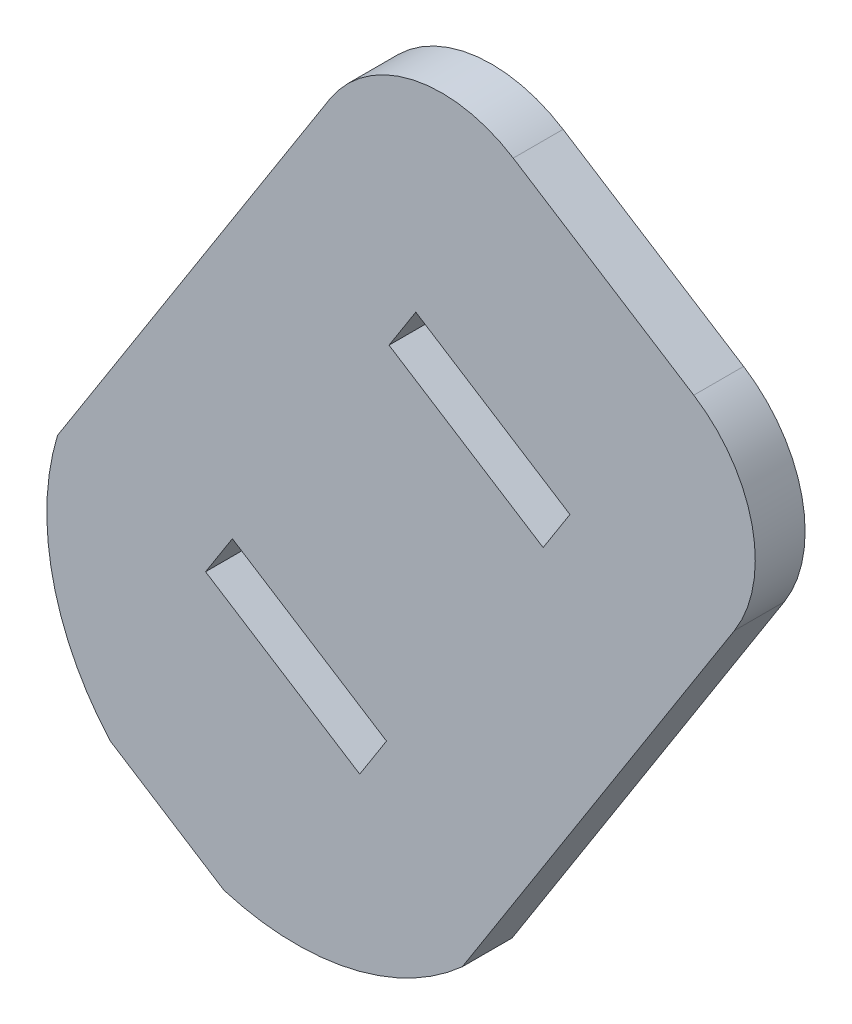
ISO-10303-21;
HEADER;
FILE_DESCRIPTION(('STEP AP214'),'2;1');
FILE_NAME('part.step','',(''),(''),'','','');
FILE_SCHEMA(('AUTOMOTIVE_DESIGN { 1 0 10303 214 1 1 1 1 }'));
ENDSEC;
DATA;
#1=APPLICATION_CONTEXT('core data for automotive mechanical design processes');
#2=APPLICATION_PROTOCOL_DEFINITION('international standard','automotive_design',2000,#1);
#3=PRODUCT_CONTEXT('',#1,'mechanical');
#4=PRODUCT('Part','Part','',(#3));
#5=PRODUCT_RELATED_PRODUCT_CATEGORY('part','',(#4));
#6=PRODUCT_DEFINITION_FORMATION('','',#4);
#7=PRODUCT_DEFINITION_CONTEXT('part definition',#1,'design');
#8=PRODUCT_DEFINITION('design','',#6,#7);
#9=PRODUCT_DEFINITION_SHAPE('','',#8);
#10=(LENGTH_UNIT() NAMED_UNIT(*) SI_UNIT(.MILLI.,.METRE.));
#11=(NAMED_UNIT(*) PLANE_ANGLE_UNIT() SI_UNIT($,.RADIAN.));
#12=(NAMED_UNIT(*) SI_UNIT($,.STERADIAN.) SOLID_ANGLE_UNIT());
#13=UNCERTAINTY_MEASURE_WITH_UNIT(LENGTH_MEASURE(1.E-05),#10,'distance_accuracy_value','');
#14=(GEOMETRIC_REPRESENTATION_CONTEXT(3) GLOBAL_UNCERTAINTY_ASSIGNED_CONTEXT((#13)) GLOBAL_UNIT_ASSIGNED_CONTEXT((#10,
#11,#12)) REPRESENTATION_CONTEXT('',''));
#15=CARTESIAN_POINT('',(0.,0.,0.));
#16=DIRECTION('',(0.,0.,1.));
#17=DIRECTION('',(1.,0.,0.));
#18=AXIS2_PLACEMENT_3D('',#15,#16,#17);
#19=CARTESIAN_POINT('',(20.1241157801377,21.2297377830745,-7.99999999999974));
#20=DIRECTION('',(0.,0.,-1.));
#21=DIRECTION('',(-1.,0.,0.));
#22=AXIS2_PLACEMENT_3D('',#19,#20,#21);
#23=PLANE('',#22);
#24=CARTESIAN_POINT('',(-35.8758842198621,30.3873470763571,-8.00000000000022));
#25=DIRECTION('',(0.,0.,-1.));
#26=DIRECTION('',(-1.,0.,0.));
#27=AXIS2_PLACEMENT_3D('',#24,#25,#26);
#28=CIRCLE('',#27,8.00000000000001);
#29=CARTESIAN_POINT('',(-43.8758842198621,30.3873470763571,-8.00000000000029));
#30=VERTEX_POINT('',#29);
#31=EDGE_CURVE('E164',#30,#30,#28,.F.);
#32=ORIENTED_EDGE('',*,*,#31,.F.);
#33=EDGE_LOOP('',(#32));
#34=FACE_BOUND('',#33,.T.);
#35=DIRECTION('',(0.537299608354291,0.843391445808129,0.));
#36=VECTOR('',#35,1.);
#37=CARTESIAN_POINT('',(-19.2203489028126,46.2949261604625,-8.00000000000013));
#38=LINE('',#37,#36);
#39=CARTESIAN_POINT('',(-32.0431806804489,26.1671120616963,-8.00000000000018));
#40=VERTEX_POINT('',#39);
#41=CARTESIAN_POINT('',(-30.431281855386,28.6972863991207,-8.00000000000018));
#42=VERTEX_POINT('',#41);
#43=EDGE_CURVE('E225',#40,#42,#38,.T.);
#44=ORIENTED_EDGE('',*,*,#43,.T.);
#45=DIRECTION('',(-0.84339144580813,0.53729960835429,0.));
#46=VECTOR('',#45,1.);
#47=CARTESIAN_POINT('',(8.91318282756435,3.63209802173272,-7.99999999999979));
#48=LINE('',#47,#46);
#49=CARTESIAN_POINT('',(-39.7085877592754,34.6075820910179,-8.00000000000027));
#50=VERTEX_POINT('',#49);
#51=EDGE_CURVE('E231',#42,#50,#48,.T.);
#52=ORIENTED_EDGE('',*,*,#51,.T.);
#53=DIRECTION('',(-0.53729960835429,-0.843391445808129,0.));
#54=VECTOR('',#53,1.);
#55=CARTESIAN_POINT('',(-28.4976548067021,52.2052218523597,-8.00000000000022));
#56=LINE('',#55,#54);
#57=CARTESIAN_POINT('',(-41.3204865843383,32.0774077535935,-8.00000000000023));
#58=VERTEX_POINT('',#57);
#59=EDGE_CURVE('E229',#50,#58,#56,.T.);
#60=ORIENTED_EDGE('',*,*,#59,.T.);
#61=DIRECTION('',(0.843391445808129,-0.53729960835429,0.));
#62=VECTOR('',#61,1.);
#63=CARTESIAN_POINT('',(7.30128400250146,1.10192368430831,-7.99999999999979));
#64=LINE('',#63,#62);
#65=EDGE_CURVE('E207',#58,#40,#64,.T.);
#66=ORIENTED_EDGE('',*,*,#65,.T.);
#67=EDGE_LOOP('',(#44,#52,#60,#66));
#68=FACE_BOUND('',#67,.T.);
#69=ADVANCED_FACE('F45',(#34,#68),#23,.T.);
#70=CARTESIAN_POINT('',(0.,0.,3.));
#71=DIRECTION('',(0.,0.,1.));
#72=DIRECTION('',(1.,0.,0.));
#73=AXIS2_PLACEMENT_3D('',#70,#71,#72);
#74=PLANE('',#73);
#75=CARTESIAN_POINT('',(-16.2349408365906,49.2271392015348,3.));
#76=DIRECTION('',(0.,0.,1.));
#77=DIRECTION('',(1.,0.,0.));
#78=AXIS2_PLACEMENT_3D('',#75,#76,#77);
#79=CIRCLE('',#78,8.);
#80=CARTESIAN_POINT('',(-11.9365439697563,55.9742707679999,3.));
#81=VERTEX_POINT('',#80);
#82=CARTESIAN_POINT('',(-9.48780927012557,44.9287423347004,3.));
#83=VERTEX_POINT('',#82);
#84=EDGE_CURVE('E235',#81,#83,#79,.F.);
#85=ORIENTED_EDGE('',*,*,#84,.F.);
#86=DIRECTION('',(-0.843391445808129,0.53729960835429,0.));
#87=VECTOR('',#86,1.);
#88=CARTESIAN_POINT('',(21.9189874824485,34.4059185155461,3.));
#89=LINE('',#88,#87);
#90=CARTESIAN_POINT('',(-22.8034583949571,62.8972587751705,3.));
#91=VERTEX_POINT('',#90);
#92=EDGE_CURVE('E238',#81,#91,#89,.T.);
#93=ORIENTED_EDGE('',*,*,#92,.T.);
#94=CARTESIAN_POINT('',(-27.1018552617915,56.1501272087055,3.));
#95=DIRECTION('',(0.,0.,1.));
#96=DIRECTION('',(1.,0.,0.));
#97=AXIS2_PLACEMENT_3D('',#94,#95,#96);
#98=CIRCLE('',#97,8.);
#99=CARTESIAN_POINT('',(-33.8489868282565,60.4485240755397,3.));
#100=VERTEX_POINT('',#99);
#101=EDGE_CURVE('E241',#91,#100,#98,.T.);
#102=ORIENTED_EDGE('',*,*,#101,.T.);
#103=DIRECTION('',(0.53729960835429,0.843391445808129,0.));
#104=VECTOR('',#103,1.);
#105=CARTESIAN_POINT('',(-51.4695774438707,32.7897371264587,3.));
#106=LINE('',#105,#104);
#107=CARTESIAN_POINT('',(-50.2335212839121,34.729956653215,3.));
#108=VERTEX_POINT('',#107);
#109=EDGE_CURVE('E243',#108,#100,#106,.T.);
#110=ORIENTED_EDGE('',*,*,#109,.F.);
#111=CARTESIAN_POINT('',(-35.8758842198621,30.3873470763571,3.));
#112=DIRECTION('',(0.,0.,1.));
#113=DIRECTION('',(1.,0.,0.));
#114=AXIS2_PLACEMENT_3D('',#111,#112,#113);
#115=CIRCLE('',#114,15.);
#116=CARTESIAN_POINT('',(-47.0530563838433,20.3838065822758,3.));
#117=VERTEX_POINT('',#116);
#118=EDGE_CURVE('E246',#108,#117,#115,.T.);
#119=ORIENTED_EDGE('',*,*,#118,.T.);
#120=DIRECTION('',(0.84339144580813,-0.53729960835429,0.));
#121=VECTOR('',#120,1.);
#122=CARTESIAN_POINT('',(-4.34678642547666,-6.82308795874752,3.));
#123=LINE('',#122,#121);
#124=CARTESIAN_POINT('',(-40.2184937967205,16.0297100123073,3.));
#125=VERTEX_POINT('',#124);
#126=EDGE_CURVE('E248',#117,#125,#123,.T.);
#127=ORIENTED_EDGE('',*,*,#126,.T.);
#128=CARTESIAN_POINT('',(-35.8758842198621,30.3873470763571,3.));
#129=DIRECTION('',(0.,0.,1.));
#130=DIRECTION('',(1.,0.,0.));
#131=AXIS2_PLACEMENT_3D('',#128,#129,#130);
#132=CIRCLE('',#131,15.);
#133=CARTESIAN_POINT('',(-25.8723437257803,19.2101749123764,3.));
#134=VERTEX_POINT('',#133);
#135=EDGE_CURVE('E250',#125,#134,#132,.T.);
#136=ORIENTED_EDGE('',*,*,#135,.T.);
#137=DIRECTION('',(0.537299608354281,0.843391445808135,0.));
#138=VECTOR('',#137,1.);
#139=CARTESIAN_POINT('',(-27.1083998857396,17.2699553856189,3.));
#140=LINE('',#139,#138);
#141=EDGE_CURVE('E252',#134,#83,#140,.T.);
#142=ORIENTED_EDGE('',*,*,#141,.T.);
#143=EDGE_LOOP('',(#85,#93,#102,#110,#119,#127,#136,#142));
#144=FACE_BOUND('',#143,.T.);
#145=DIRECTION('',(0.53729960835429,0.843391445808129,0.));
#146=VECTOR('',#145,1.);
#147=CARTESIAN_POINT('',(-43.9276416167499,27.9849941019876,3.));
#148=LINE('',#147,#146);
#149=CARTESIAN_POINT('',(-41.3204865843383,32.0774077535935,3.));
#150=VERTEX_POINT('',#149);
#151=CARTESIAN_POINT('',(-39.7085877592754,34.6075820910179,3.));
#152=VERTEX_POINT('',#151);
#153=EDGE_CURVE('E52',#150,#152,#148,.T.);
#154=ORIENTED_EDGE('',*,*,#153,.T.);
#155=DIRECTION('',(0.84339144580813,-0.53729960835429,0.));
#156=VECTOR('',#155,1.);
#157=CARTESIAN_POINT('',(4.21905385747451,6.62258798903028,3.));
#158=LINE('',#157,#156);
#159=CARTESIAN_POINT('',(-30.431281855386,28.6972863991207,3.));
#160=VERTEX_POINT('',#159);
#161=EDGE_CURVE('E11',#152,#160,#158,.T.);
#162=ORIENTED_EDGE('',*,*,#161,.T.);
#163=DIRECTION('',(-0.537299608354291,-0.843391445808129,0.));
#164=VECTOR('',#163,1.);
#165=CARTESIAN_POINT('',(-34.6503357128605,22.0746984100905,3.));
#166=LINE('',#165,#164);
#167=CARTESIAN_POINT('',(-32.0431806804489,26.1671120616963,3.));
#168=VERTEX_POINT('',#167);
#169=EDGE_CURVE('E184',#160,#168,#166,.T.);
#170=ORIENTED_EDGE('',*,*,#169,.T.);
#171=DIRECTION('',(-0.843391445808129,0.53729960835429,0.));
#172=VECTOR('',#171,1.);
#173=CARTESIAN_POINT('',(2.60715503241163,4.09241365160587,3.));
#174=LINE('',#173,#172);
#175=EDGE_CURVE('E187',#168,#150,#174,.T.);
#176=ORIENTED_EDGE('',*,*,#175,.T.);
#177=EDGE_LOOP('',(#154,#162,#170,#176));
#178=FACE_BOUND('',#177,.T.);
#179=DIRECTION('',(0.53729960835429,0.843391445808129,0.));
#180=VECTOR('',#179,1.);
#181=CARTESIAN_POINT('',(-43.9276416167499,27.9849941019876,3.));
#182=LINE('',#181,#180);
#183=CARTESIAN_POINT('',(-30.2797304328479,49.4079234447207,3.));
#184=VERTEX_POINT('',#183);
#185=CARTESIAN_POINT('',(-28.667831607785,51.9380977821451,3.));
#186=VERTEX_POINT('',#185);
#187=EDGE_CURVE('E219',#184,#186,#182,.T.);
#188=ORIENTED_EDGE('',*,*,#187,.T.);
#189=DIRECTION('',(0.84339144580813,-0.53729960835429,0.));
#190=VECTOR('',#189,1.);
#191=CARTESIAN_POINT('',(15.2598100089649,23.9531036801574,3.));
#192=LINE('',#191,#190);
#193=CARTESIAN_POINT('',(-19.3905257038956,46.0278020902479,3.));
#194=VERTEX_POINT('',#193);
#195=EDGE_CURVE('E222',#186,#194,#192,.T.);
#196=ORIENTED_EDGE('',*,*,#195,.T.);
#197=DIRECTION('',(-0.53729960835429,-0.843391445808129,0.));
#198=VECTOR('',#197,1.);
#199=CARTESIAN_POINT('',(-34.6503357128605,22.0746984100904,3.));
#200=LINE('',#199,#198);
#201=CARTESIAN_POINT('',(-21.0024245289584,43.4976277528235,3.));
#202=VERTEX_POINT('',#201);
#203=EDGE_CURVE('E215',#194,#202,#200,.T.);
#204=ORIENTED_EDGE('',*,*,#203,.T.);
#205=DIRECTION('',(-0.84339144580813,0.53729960835429,0.));
#206=VECTOR('',#205,1.);
#207=CARTESIAN_POINT('',(13.647911183902,21.422929342733,3.));
#208=LINE('',#207,#206);
#209=EDGE_CURVE('E171',#202,#184,#208,.T.);
#210=ORIENTED_EDGE('',*,*,#209,.T.);
#211=EDGE_LOOP('',(#188,#196,#204,#210));
#212=FACE_BOUND('',#211,.T.);
#213=ADVANCED_FACE('F191',(#144,#178,#212),#74,.T.);
#214=CARTESIAN_POINT('',(0.,0.,0.));
#215=DIRECTION('',(0.,0.,1.));
#216=DIRECTION('',(1.,0.,0.));
#217=AXIS2_PLACEMENT_3D('',#214,#215,#216);
#218=PLANE('',#217);
#219=CARTESIAN_POINT('',(-16.2349408365906,49.2271392015348,0.));
#220=DIRECTION('',(0.,0.,1.));
#221=DIRECTION('',(1.,0.,0.));
#222=AXIS2_PLACEMENT_3D('',#219,#220,#221);
#223=CIRCLE('',#222,8.);
#224=CARTESIAN_POINT('',(-11.9365439697563,55.9742707679999,0.));
#225=VERTEX_POINT('',#224);
#226=CARTESIAN_POINT('',(-9.48780927012557,44.9287423347004,0.));
#227=VERTEX_POINT('',#226);
#228=EDGE_CURVE('E234',#225,#227,#223,.F.);
#229=ORIENTED_EDGE('',*,*,#228,.T.);
#230=DIRECTION('',(0.537299608354281,0.843391445808135,0.));
#231=VECTOR('',#230,1.);
#232=CARTESIAN_POINT('',(-27.1083998857396,17.2699553856189,0.));
#233=LINE('',#232,#231);
#234=CARTESIAN_POINT('',(-25.8723437257803,19.2101749123764,0.));
#235=VERTEX_POINT('',#234);
#236=EDGE_CURVE('E239',#235,#227,#233,.T.);
#237=ORIENTED_EDGE('',*,*,#236,.F.);
#238=CARTESIAN_POINT('',(-35.8758842198621,30.3873470763571,0.));
#239=DIRECTION('',(0.,0.,1.));
#240=DIRECTION('',(1.,0.,0.));
#241=AXIS2_PLACEMENT_3D('',#238,#239,#240);
#242=CIRCLE('',#241,15.);
#243=CARTESIAN_POINT('',(-40.2184937967205,16.0297100123073,0.));
#244=VERTEX_POINT('',#243);
#245=EDGE_CURVE('E269',#244,#235,#242,.T.);
#246=ORIENTED_EDGE('',*,*,#245,.F.);
#247=DIRECTION('',(0.84339144580813,-0.53729960835429,0.));
#248=VECTOR('',#247,1.);
#249=CARTESIAN_POINT('',(-4.34678642547666,-6.82308795874752,0.));
#250=LINE('',#249,#248);
#251=CARTESIAN_POINT('',(-47.0530563838433,20.3838065822758,0.));
#252=VERTEX_POINT('',#251);
#253=EDGE_CURVE('E267',#252,#244,#250,.T.);
#254=ORIENTED_EDGE('',*,*,#253,.F.);
#255=CARTESIAN_POINT('',(-35.8758842198621,30.3873470763571,0.));
#256=DIRECTION('',(0.,0.,1.));
#257=DIRECTION('',(1.,0.,0.));
#258=AXIS2_PLACEMENT_3D('',#255,#256,#257);
#259=CIRCLE('',#258,15.);
#260=CARTESIAN_POINT('',(-50.2335212839121,34.729956653215,0.));
#261=VERTEX_POINT('',#260);
#262=EDGE_CURVE('E265',#261,#252,#259,.T.);
#263=ORIENTED_EDGE('',*,*,#262,.F.);
#264=DIRECTION('',(0.53729960835429,0.843391445808129,0.));
#265=VECTOR('',#264,1.);
#266=CARTESIAN_POINT('',(-51.4695774438707,32.7897371264587,0.));
#267=LINE('',#266,#265);
#268=CARTESIAN_POINT('',(-33.8489868282565,60.4485240755397,0.));
#269=VERTEX_POINT('',#268);
#270=EDGE_CURVE('E262',#261,#269,#267,.T.);
#271=ORIENTED_EDGE('',*,*,#270,.T.);
#272=CARTESIAN_POINT('',(-27.1018552617915,56.1501272087055,0.));
#273=DIRECTION('',(0.,0.,1.));
#274=DIRECTION('',(1.,0.,0.));
#275=AXIS2_PLACEMENT_3D('',#272,#273,#274);
#276=CIRCLE('',#275,8.);
#277=CARTESIAN_POINT('',(-22.8034583949571,62.8972587751705,0.));
#278=VERTEX_POINT('',#277);
#279=EDGE_CURVE('E259',#278,#269,#276,.T.);
#280=ORIENTED_EDGE('',*,*,#279,.F.);
#281=DIRECTION('',(-0.843391445808129,0.53729960835429,0.));
#282=VECTOR('',#281,1.);
#283=CARTESIAN_POINT('',(21.9189874824485,34.4059185155461,0.));
#284=LINE('',#283,#282);
#285=EDGE_CURVE('E257',#225,#278,#284,.T.);
#286=ORIENTED_EDGE('',*,*,#285,.F.);
#287=EDGE_LOOP('',(#229,#237,#246,#254,#263,#271,#280,#286));
#288=FACE_BOUND('',#287,.T.);
#289=CARTESIAN_POINT('',(-35.8758842198621,30.3873470763571,0.));
#290=DIRECTION('',(0.,0.,1.));
#291=DIRECTION('',(1.,0.,0.));
#292=AXIS2_PLACEMENT_3D('',#289,#290,#291);
#293=CIRCLE('',#292,8.00000000000001);
#294=CARTESIAN_POINT('',(-27.8758842198621,30.3873470763571,0.));
#295=VERTEX_POINT('',#294);
#296=EDGE_CURVE('E292',#295,#295,#293,.T.);
#297=ORIENTED_EDGE('',*,*,#296,.T.);
#298=EDGE_LOOP('',(#297));
#299=FACE_BOUND('',#298,.T.);
#300=DIRECTION('',(0.84339144580813,-0.53729960835429,0.));
#301=VECTOR('',#300,1.);
#302=CARTESIAN_POINT('',(15.2598100089649,23.9531036801574,0.));
#303=LINE('',#302,#301);
#304=CARTESIAN_POINT('',(-28.667831607785,51.9380977821451,0.));
#305=VERTEX_POINT('',#304);
#306=CARTESIAN_POINT('',(-19.3905257038956,46.0278020902479,0.));
#307=VERTEX_POINT('',#306);
#308=EDGE_CURVE('E179',#305,#307,#303,.T.);
#309=ORIENTED_EDGE('',*,*,#308,.F.);
#310=DIRECTION('',(0.53729960835429,0.843391445808129,0.));
#311=VECTOR('',#310,1.);
#312=CARTESIAN_POINT('',(-43.9276416167499,27.9849941019876,0.));
#313=LINE('',#312,#311);
#314=CARTESIAN_POINT('',(-30.2797304328479,49.4079234447207,0.));
#315=VERTEX_POINT('',#314);
#316=EDGE_CURVE('E177',#315,#305,#313,.T.);
#317=ORIENTED_EDGE('',*,*,#316,.F.);
#318=DIRECTION('',(-0.84339144580813,0.53729960835429,0.));
#319=VECTOR('',#318,1.);
#320=CARTESIAN_POINT('',(13.647911183902,21.422929342733,0.));
#321=LINE('',#320,#319);
#322=CARTESIAN_POINT('',(-21.0024245289584,43.4976277528235,0.));
#323=VERTEX_POINT('',#322);
#324=EDGE_CURVE('E163',#323,#315,#321,.T.);
#325=ORIENTED_EDGE('',*,*,#324,.F.);
#326=DIRECTION('',(-0.53729960835429,-0.843391445808129,0.));
#327=VECTOR('',#326,1.);
#328=CARTESIAN_POINT('',(-34.6503357128605,22.0746984100904,0.));
#329=LINE('',#328,#327);
#330=EDGE_CURVE('E155',#307,#323,#329,.T.);
#331=ORIENTED_EDGE('',*,*,#330,.F.);
#332=EDGE_LOOP('',(#309,#317,#325,#331));
#333=FACE_BOUND('',#332,.T.);
#334=ADVANCED_FACE('F176',(#288,#299,#333),#218,.F.);
#335=CARTESIAN_POINT('',(-35.8758842198621,30.3873470763571,-30.6274169979698));
#336=DIRECTION('',(0.,0.,1.));
#337=DIRECTION('',(1.,0.,0.));
#338=AXIS2_PLACEMENT_3D('',#335,#336,#337);
#339=CYLINDRICAL_SURFACE('',#338,8.00000000000001);
#340=ORIENTED_EDGE('',*,*,#296,.F.);
#341=EDGE_LOOP('',(#340));
#342=FACE_BOUND('',#341,.T.);
#343=ORIENTED_EDGE('',*,*,#31,.T.);
#344=EDGE_LOOP('',(#343));
#345=FACE_BOUND('',#344,.T.);
#346=ADVANCED_FACE('F297',(#342,#345),#339,.T.);
#347=CARTESIAN_POINT('',(-16.2349408365906,49.2271392015348,3.));
#348=DIRECTION('',(0.,0.,-1.));
#349=DIRECTION('',(-1.,0.,0.));
#350=AXIS2_PLACEMENT_3D('',#347,#348,#349);
#351=CYLINDRICAL_SURFACE('',#350,8.);
#352=ORIENTED_EDGE('',*,*,#228,.F.);
#353=DIRECTION('',(0.,0.,-1.));
#354=VECTOR('',#353,1.);
#355=CARTESIAN_POINT('',(-11.9365439697563,55.9742707679999,3.));
#356=LINE('',#355,#354);
#357=EDGE_CURVE('E290',#81,#225,#356,.T.);
#358=ORIENTED_EDGE('',*,*,#357,.F.);
#359=ORIENTED_EDGE('',*,*,#84,.T.);
#360=DIRECTION('',(0.,0.,-1.));
#361=VECTOR('',#360,1.);
#362=CARTESIAN_POINT('',(-9.48780927012557,44.9287423347004,3.));
#363=LINE('',#362,#361);
#364=EDGE_CURVE('E254',#83,#227,#363,.T.);
#365=ORIENTED_EDGE('',*,*,#364,.T.);
#366=EDGE_LOOP('',(#352,#358,#359,#365));
#367=FACE_BOUND('',#366,.T.);
#368=ADVANCED_FACE('F353',(#367),#351,.T.);
#369=CARTESIAN_POINT('',(21.9189874824485,34.4059185155461,3.));
#370=DIRECTION('',(-0.53729960835429,-0.843391445808129,0.));
#371=DIRECTION('',(0.84339144580813,-0.53729960835429,0.));
#372=AXIS2_PLACEMENT_3D('',#369,#370,#371);
#373=PLANE('',#372);
#374=ORIENTED_EDGE('',*,*,#285,.T.);
#375=DIRECTION('',(0.,0.,-1.));
#376=VECTOR('',#375,1.);
#377=CARTESIAN_POINT('',(-22.8034583949571,62.8972587751705,3.));
#378=LINE('',#377,#376);
#379=EDGE_CURVE('E287',#91,#278,#378,.T.);
#380=ORIENTED_EDGE('',*,*,#379,.F.);
#381=ORIENTED_EDGE('',*,*,#92,.F.);
#382=ORIENTED_EDGE('',*,*,#357,.T.);
#383=EDGE_LOOP('',(#374,#380,#381,#382));
#384=FACE_BOUND('',#383,.T.);
#385=ADVANCED_FACE('F349',(#384),#373,.F.);
#386=CARTESIAN_POINT('',(-27.1018552617915,56.1501272087055,3.));
#387=DIRECTION('',(0.,0.,-1.));
#388=DIRECTION('',(-1.,0.,0.));
#389=AXIS2_PLACEMENT_3D('',#386,#387,#388);
#390=CYLINDRICAL_SURFACE('',#389,8.);
#391=ORIENTED_EDGE('',*,*,#279,.T.);
#392=DIRECTION('',(0.,0.,-1.));
#393=VECTOR('',#392,1.);
#394=CARTESIAN_POINT('',(-33.8489868282565,60.4485240755397,3.));
#395=LINE('',#394,#393);
#396=EDGE_CURVE('E285',#100,#269,#395,.T.);
#397=ORIENTED_EDGE('',*,*,#396,.F.);
#398=ORIENTED_EDGE('',*,*,#101,.F.);
#399=ORIENTED_EDGE('',*,*,#379,.T.);
#400=EDGE_LOOP('',(#391,#397,#398,#399));
#401=FACE_BOUND('',#400,.T.);
#402=ADVANCED_FACE('F345',(#401),#390,.T.);
#403=CARTESIAN_POINT('',(-51.4695774438707,32.7897371264587,3.));
#404=DIRECTION('',(-0.843391445808129,0.53729960835429,0.));
#405=DIRECTION('',(-0.53729960835429,-0.843391445808129,0.));
#406=AXIS2_PLACEMENT_3D('',#403,#404,#405);
#407=PLANE('',#406);
#408=ORIENTED_EDGE('',*,*,#270,.F.);
#409=DIRECTION('',(0.,0.,-1.));
#410=VECTOR('',#409,1.);
#411=CARTESIAN_POINT('',(-50.2335212839121,34.729956653215,3.));
#412=LINE('',#411,#410);
#413=EDGE_CURVE('E283',#108,#261,#412,.T.);
#414=ORIENTED_EDGE('',*,*,#413,.F.);
#415=ORIENTED_EDGE('',*,*,#109,.T.);
#416=ORIENTED_EDGE('',*,*,#396,.T.);
#417=EDGE_LOOP('',(#408,#414,#415,#416));
#418=FACE_BOUND('',#417,.T.);
#419=ADVANCED_FACE('F341',(#418),#407,.T.);
#420=CARTESIAN_POINT('',(-35.8758842198621,30.3873470763571,3.));
#421=DIRECTION('',(0.,0.,-1.));
#422=DIRECTION('',(-1.,0.,0.));
#423=AXIS2_PLACEMENT_3D('',#420,#421,#422);
#424=CYLINDRICAL_SURFACE('',#423,15.);
#425=ORIENTED_EDGE('',*,*,#262,.T.);
#426=DIRECTION('',(0.,0.,-1.));
#427=VECTOR('',#426,1.);
#428=CARTESIAN_POINT('',(-47.0530563838433,20.3838065822758,3.));
#429=LINE('',#428,#427);
#430=EDGE_CURVE('E280',#117,#252,#429,.T.);
#431=ORIENTED_EDGE('',*,*,#430,.F.);
#432=ORIENTED_EDGE('',*,*,#118,.F.);
#433=ORIENTED_EDGE('',*,*,#413,.T.);
#434=EDGE_LOOP('',(#425,#431,#432,#433));
#435=FACE_BOUND('',#434,.T.);
#436=ADVANCED_FACE('F337',(#435),#424,.T.);
#437=CARTESIAN_POINT('',(-4.34678642547666,-6.82308795874752,3.));
#438=DIRECTION('',(0.53729960835429,0.843391445808129,0.));
#439=DIRECTION('',(-0.84339144580813,0.53729960835429,0.));
#440=AXIS2_PLACEMENT_3D('',#437,#438,#439);
#441=PLANE('',#440);
#442=ORIENTED_EDGE('',*,*,#253,.T.);
#443=DIRECTION('',(0.,0.,-1.));
#444=VECTOR('',#443,1.);
#445=CARTESIAN_POINT('',(-40.2184937967205,16.0297100123073,3.));
#446=LINE('',#445,#444);
#447=EDGE_CURVE('E277',#125,#244,#446,.T.);
#448=ORIENTED_EDGE('',*,*,#447,.F.);
#449=ORIENTED_EDGE('',*,*,#126,.F.);
#450=ORIENTED_EDGE('',*,*,#430,.T.);
#451=EDGE_LOOP('',(#442,#448,#449,#450));
#452=FACE_BOUND('',#451,.T.);
#453=ADVANCED_FACE('F333',(#452),#441,.F.);
#454=CARTESIAN_POINT('',(-35.8758842198621,30.3873470763571,3.));
#455=DIRECTION('',(0.,0.,-1.));
#456=DIRECTION('',(-1.,0.,0.));
#457=AXIS2_PLACEMENT_3D('',#454,#455,#456);
#458=CYLINDRICAL_SURFACE('',#457,15.);
#459=ORIENTED_EDGE('',*,*,#245,.T.);
#460=DIRECTION('',(0.,0.,-1.));
#461=VECTOR('',#460,1.);
#462=CARTESIAN_POINT('',(-25.8723437257803,19.2101749123764,3.));
#463=LINE('',#462,#461);
#464=EDGE_CURVE('E274',#134,#235,#463,.T.);
#465=ORIENTED_EDGE('',*,*,#464,.F.);
#466=ORIENTED_EDGE('',*,*,#135,.F.);
#467=ORIENTED_EDGE('',*,*,#447,.T.);
#468=EDGE_LOOP('',(#459,#465,#466,#467));
#469=FACE_BOUND('',#468,.T.);
#470=ADVANCED_FACE('F329',(#469),#458,.T.);
#471=CARTESIAN_POINT('',(-27.1083998857396,17.2699553856189,3.));
#472=DIRECTION('',(-0.843391445808135,0.537299608354281,0.));
#473=DIRECTION('',(-0.537299608354281,-0.843391445808135,0.));
#474=AXIS2_PLACEMENT_3D('',#471,#472,#473);
#475=PLANE('',#474);
#476=ORIENTED_EDGE('',*,*,#236,.T.);
#477=ORIENTED_EDGE('',*,*,#364,.F.);
#478=ORIENTED_EDGE('',*,*,#141,.F.);
#479=ORIENTED_EDGE('',*,*,#464,.T.);
#480=EDGE_LOOP('',(#476,#477,#478,#479));
#481=FACE_BOUND('',#480,.T.);
#482=ADVANCED_FACE('F326',(#481),#475,.F.);
#483=CARTESIAN_POINT('',(-28.667831607785,51.9380977821451,10.));
#484=DIRECTION('',(-0.53729960835429,-0.84339144580813,0.));
#485=DIRECTION('',(0.84339144580813,-0.53729960835429,0.));
#486=AXIS2_PLACEMENT_3D('',#483,#484,#485);
#487=PLANE('',#486);
#488=DIRECTION('',(0.,0.,-1.));
#489=VECTOR('',#488,1.);
#490=CARTESIAN_POINT('',(-28.667831607785,51.9380977821451,10.));
#491=LINE('',#490,#489);
#492=EDGE_CURVE('E217',#186,#305,#491,.T.);
#493=ORIENTED_EDGE('',*,*,#492,.T.);
#494=ORIENTED_EDGE('',*,*,#308,.T.);
#495=DIRECTION('',(0.,0.,-1.));
#496=VECTOR('',#495,1.);
#497=CARTESIAN_POINT('',(-19.3905257038956,46.0278020902479,10.));
#498=LINE('',#497,#496);
#499=EDGE_CURVE('E158',#194,#307,#498,.T.);
#500=ORIENTED_EDGE('',*,*,#499,.F.);
#501=ORIENTED_EDGE('',*,*,#195,.F.);
#502=EDGE_LOOP('',(#493,#494,#500,#501));
#503=FACE_BOUND('',#502,.T.);
#504=ADVANCED_FACE('F313',(#503),#487,.T.);
#505=CARTESIAN_POINT('',(-28.667831607785,51.9380977821451,10.));
#506=DIRECTION('',(0.843391445808129,-0.53729960835429,0.));
#507=DIRECTION('',(0.53729960835429,0.843391445808129,0.));
#508=AXIS2_PLACEMENT_3D('',#505,#506,#507);
#509=PLANE('',#508);
#510=DIRECTION('',(0.,0.,-1.));
#511=VECTOR('',#510,1.);
#512=CARTESIAN_POINT('',(-30.2797304328479,49.4079234447207,10.));
#513=LINE('',#512,#511);
#514=EDGE_CURVE('E173',#184,#315,#513,.T.);
#515=ORIENTED_EDGE('',*,*,#514,.T.);
#516=ORIENTED_EDGE('',*,*,#316,.T.);
#517=ORIENTED_EDGE('',*,*,#492,.F.);
#518=ORIENTED_EDGE('',*,*,#187,.F.);
#519=EDGE_LOOP('',(#515,#516,#517,#518));
#520=FACE_BOUND('',#519,.T.);
#521=ADVANCED_FACE('F427',(#520),#509,.T.);
#522=CARTESIAN_POINT('',(-30.2797304328479,49.4079234447207,10.));
#523=DIRECTION('',(0.53729960835429,0.84339144580813,0.));
#524=DIRECTION('',(-0.84339144580813,0.53729960835429,0.));
#525=AXIS2_PLACEMENT_3D('',#522,#523,#524);
#526=PLANE('',#525);
#527=DIRECTION('',(0.,0.,-1.));
#528=VECTOR('',#527,1.);
#529=CARTESIAN_POINT('',(-21.0024245289584,43.4976277528235,10.));
#530=LINE('',#529,#528);
#531=EDGE_CURVE('E67',#202,#323,#530,.T.);
#532=ORIENTED_EDGE('',*,*,#531,.T.);
#533=ORIENTED_EDGE('',*,*,#324,.T.);
#534=ORIENTED_EDGE('',*,*,#514,.F.);
#535=ORIENTED_EDGE('',*,*,#209,.F.);
#536=EDGE_LOOP('',(#532,#533,#534,#535));
#537=FACE_BOUND('',#536,.T.);
#538=ADVANCED_FACE('F167',(#537),#526,.T.);
#539=CARTESIAN_POINT('',(-19.3905257038956,46.0278020902479,10.));
#540=DIRECTION('',(-0.843391445808129,0.53729960835429,0.));
#541=DIRECTION('',(-0.53729960835429,-0.843391445808129,0.));
#542=AXIS2_PLACEMENT_3D('',#539,#540,#541);
#543=PLANE('',#542);
#544=ORIENTED_EDGE('',*,*,#499,.T.);
#545=ORIENTED_EDGE('',*,*,#330,.T.);
#546=ORIENTED_EDGE('',*,*,#531,.F.);
#547=ORIENTED_EDGE('',*,*,#203,.F.);
#548=EDGE_LOOP('',(#544,#545,#546,#547));
#549=FACE_BOUND('',#548,.T.);
#550=ADVANCED_FACE('F156',(#549),#543,.T.);
#551=CARTESIAN_POINT('',(-39.7085877592754,34.6075820910179,10.));
#552=DIRECTION('',(-0.53729960835429,-0.84339144580813,0.));
#553=DIRECTION('',(0.84339144580813,-0.53729960835429,0.));
#554=AXIS2_PLACEMENT_3D('',#551,#552,#553);
#555=PLANE('',#554);
#556=DIRECTION('',(0.,0.,-1.));
#557=VECTOR('',#556,1.);
#558=CARTESIAN_POINT('',(-30.431281855386,28.6972863991207,10.));
#559=LINE('',#558,#557);
#560=EDGE_CURVE('E59',#160,#42,#559,.T.);
#561=ORIENTED_EDGE('',*,*,#560,.F.);
#562=ORIENTED_EDGE('',*,*,#161,.F.);
#563=DIRECTION('',(0.,0.,-1.));
#564=VECTOR('',#563,1.);
#565=CARTESIAN_POINT('',(-39.7085877592754,34.6075820910179,10.));
#566=LINE('',#565,#564);
#567=EDGE_CURVE('E202',#152,#50,#566,.T.);
#568=ORIENTED_EDGE('',*,*,#567,.T.);
#569=ORIENTED_EDGE('',*,*,#51,.F.);
#570=EDGE_LOOP('',(#561,#562,#568,#569));
#571=FACE_BOUND('',#570,.T.);
#572=ADVANCED_FACE('F303',(#571),#555,.T.);
#573=CARTESIAN_POINT('',(-39.7085877592754,34.6075820910179,10.));
#574=DIRECTION('',(0.843391445808129,-0.53729960835429,0.));
#575=DIRECTION('',(0.53729960835429,0.843391445808129,0.));
#576=AXIS2_PLACEMENT_3D('',#573,#574,#575);
#577=PLANE('',#576);
#578=ORIENTED_EDGE('',*,*,#567,.F.);
#579=ORIENTED_EDGE('',*,*,#153,.F.);
#580=DIRECTION('',(0.,0.,-1.));
#581=VECTOR('',#580,1.);
#582=CARTESIAN_POINT('',(-41.3204865843383,32.0774077535935,10.));
#583=LINE('',#582,#581);
#584=EDGE_CURVE('E199',#150,#58,#583,.T.);
#585=ORIENTED_EDGE('',*,*,#584,.T.);
#586=ORIENTED_EDGE('',*,*,#59,.F.);
#587=EDGE_LOOP('',(#578,#579,#585,#586));
#588=FACE_BOUND('',#587,.T.);
#589=ADVANCED_FACE('F198',(#588),#577,.T.);
#590=CARTESIAN_POINT('',(-41.3204865843383,32.0774077535935,10.));
#591=DIRECTION('',(0.53729960835429,0.843391445808129,0.));
#592=DIRECTION('',(-0.843391445808129,0.53729960835429,0.));
#593=AXIS2_PLACEMENT_3D('',#590,#591,#592);
#594=PLANE('',#593);
#595=ORIENTED_EDGE('',*,*,#584,.F.);
#596=ORIENTED_EDGE('',*,*,#175,.F.);
#597=DIRECTION('',(0.,0.,-1.));
#598=VECTOR('',#597,1.);
#599=CARTESIAN_POINT('',(-32.0431806804489,26.1671120616963,10.));
#600=LINE('',#599,#598);
#601=EDGE_CURVE('E208',#168,#40,#600,.T.);
#602=ORIENTED_EDGE('',*,*,#601,.T.);
#603=ORIENTED_EDGE('',*,*,#65,.F.);
#604=EDGE_LOOP('',(#595,#596,#602,#603));
#605=FACE_BOUND('',#604,.T.);
#606=ADVANCED_FACE('F204',(#605),#594,.T.);
#607=CARTESIAN_POINT('',(-30.431281855386,28.6972863991207,10.));
#608=DIRECTION('',(-0.843391445808129,0.537299608354291,0.));
#609=DIRECTION('',(-0.537299608354291,-0.843391445808129,0.));
#610=AXIS2_PLACEMENT_3D('',#607,#608,#609);
#611=PLANE('',#610);
#612=ORIENTED_EDGE('',*,*,#601,.F.);
#613=ORIENTED_EDGE('',*,*,#169,.F.);
#614=ORIENTED_EDGE('',*,*,#560,.T.);
#615=ORIENTED_EDGE('',*,*,#43,.F.);
#616=EDGE_LOOP('',(#612,#613,#614,#615));
#617=FACE_BOUND('',#616,.T.);
#618=ADVANCED_FACE('F301',(#617),#611,.T.);
#619=CLOSED_SHELL('',(#69,#213,#334,#346,#368,#385,#402,#419,#436,#453,#470,#482,#504,#521,#538,
#550,#572,#589,#606,#618));
#620=MANIFOLD_SOLID_BREP('B2',#619);
#621=ADVANCED_BREP_SHAPE_REPRESENTATION('',(#18,#620),#14);
#622=SHAPE_DEFINITION_REPRESENTATION(#9,#621);
ENDSEC;
END-ISO-10303-21;
